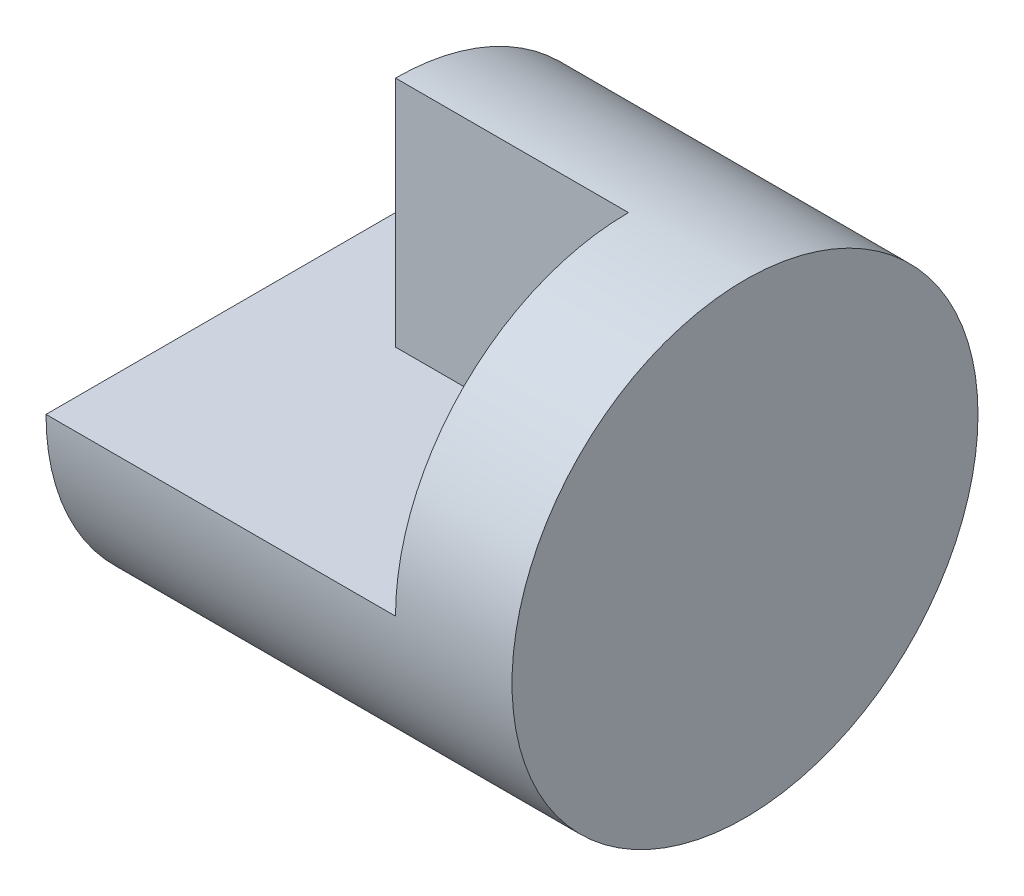
ISO-10303-21;
HEADER;
FILE_DESCRIPTION(('STEP AP214'),'2;1');
FILE_NAME('part.step','',(''),(''),'','','');
FILE_SCHEMA(('AUTOMOTIVE_DESIGN { 1 0 10303 214 1 1 1 1 }'));
ENDSEC;
DATA;
#1=APPLICATION_CONTEXT('core data for automotive mechanical design processes');
#2=APPLICATION_PROTOCOL_DEFINITION('international standard','automotive_design',2000,#1);
#3=PRODUCT_CONTEXT('',#1,'mechanical');
#4=PRODUCT('Part','Part','',(#3));
#5=PRODUCT_RELATED_PRODUCT_CATEGORY('part','',(#4));
#6=PRODUCT_DEFINITION_FORMATION('','',#4);
#7=PRODUCT_DEFINITION_CONTEXT('part definition',#1,'design');
#8=PRODUCT_DEFINITION('design','',#6,#7);
#9=PRODUCT_DEFINITION_SHAPE('','',#8);
#10=(LENGTH_UNIT() NAMED_UNIT(*) SI_UNIT(.MILLI.,.METRE.));
#11=(NAMED_UNIT(*) PLANE_ANGLE_UNIT() SI_UNIT($,.RADIAN.));
#12=(NAMED_UNIT(*) SI_UNIT($,.STERADIAN.) SOLID_ANGLE_UNIT());
#13=UNCERTAINTY_MEASURE_WITH_UNIT(LENGTH_MEASURE(1.E-05),#10,'distance_accuracy_value','');
#14=(GEOMETRIC_REPRESENTATION_CONTEXT(3) GLOBAL_UNCERTAINTY_ASSIGNED_CONTEXT((#13)) GLOBAL_UNIT_ASSIGNED_CONTEXT((#10,
#11,#12)) REPRESENTATION_CONTEXT('',''));
#15=CARTESIAN_POINT('',(0.,0.,0.));
#16=DIRECTION('',(0.,0.,1.));
#17=DIRECTION('',(1.,0.,0.));
#18=AXIS2_PLACEMENT_3D('',#15,#16,#17);
#19=CARTESIAN_POINT('',(2.,0.,0.));
#20=DIRECTION('',(-1.,0.,0.));
#21=DIRECTION('',(0.,0.,1.));
#22=AXIS2_PLACEMENT_3D('',#19,#20,#21);
#23=CYLINDRICAL_SURFACE('',#22,2.);
#24=CARTESIAN_POINT('',(2.,0.,0.));
#25=DIRECTION('',(1.,0.,0.));
#26=DIRECTION('',(0.,0.,-1.));
#27=AXIS2_PLACEMENT_3D('',#24,#25,#26);
#28=CIRCLE('',#27,2.);
#29=CARTESIAN_POINT('',(2.,0.,-2.));
#30=VERTEX_POINT('',#29);
#31=EDGE_CURVE('E86',#30,#30,#28,.T.);
#32=ORIENTED_EDGE('',*,*,#31,.F.);
#33=EDGE_LOOP('',(#32));
#34=FACE_BOUND('',#33,.T.);
#35=DIRECTION('',(-1.,0.,0.));
#36=VECTOR('',#35,1.);
#37=CARTESIAN_POINT('',(-1.,0.,-2.));
#38=LINE('',#37,#36);
#39=CARTESIAN_POINT('',(-1.,0.,-2.));
#40=VERTEX_POINT('',#39);
#41=CARTESIAN_POINT('',(-2.,0.,-2.));
#42=VERTEX_POINT('',#41);
#43=EDGE_CURVE('E47',#40,#42,#38,.T.);
#44=ORIENTED_EDGE('',*,*,#43,.F.);
#45=CARTESIAN_POINT('',(-1.,0.,0.));
#46=DIRECTION('',(-1.,0.,0.));
#47=DIRECTION('',(0.,0.,1.));
#48=AXIS2_PLACEMENT_3D('',#45,#46,#47);
#49=CIRCLE('',#48,2.);
#50=CARTESIAN_POINT('',(-1.,2.,0.));
#51=VERTEX_POINT('',#50);
#52=EDGE_CURVE('E11',#51,#40,#49,.T.);
#53=ORIENTED_EDGE('',*,*,#52,.F.);
#54=DIRECTION('',(-1.,0.,0.));
#55=VECTOR('',#54,1.);
#56=CARTESIAN_POINT('',(2.,2.,0.));
#57=LINE('',#56,#55);
#58=CARTESIAN_POINT('',(1.,2.,0.));
#59=VERTEX_POINT('',#58);
#60=EDGE_CURVE('E40',#59,#51,#57,.T.);
#61=ORIENTED_EDGE('',*,*,#60,.F.);
#62=CARTESIAN_POINT('',(1.,0.,0.));
#63=DIRECTION('',(-1.,0.,0.));
#64=DIRECTION('',(0.,0.,1.));
#65=AXIS2_PLACEMENT_3D('',#62,#63,#64);
#66=CIRCLE('',#65,2.);
#67=CARTESIAN_POINT('',(1.,0.,2.));
#68=VERTEX_POINT('',#67);
#69=EDGE_CURVE('E55',#68,#59,#66,.T.);
#70=ORIENTED_EDGE('',*,*,#69,.F.);
#71=DIRECTION('',(1.,0.,0.));
#72=VECTOR('',#71,1.);
#73=CARTESIAN_POINT('',(-2.,0.,2.));
#74=LINE('',#73,#72);
#75=CARTESIAN_POINT('',(-2.,0.,2.));
#76=VERTEX_POINT('',#75);
#77=EDGE_CURVE('E75',#76,#68,#74,.T.);
#78=ORIENTED_EDGE('',*,*,#77,.F.);
#79=CARTESIAN_POINT('',(-2.,0.,0.));
#80=DIRECTION('',(1.,0.,0.));
#81=DIRECTION('',(0.,0.,-1.));
#82=AXIS2_PLACEMENT_3D('',#79,#80,#81);
#83=CIRCLE('',#82,2.);
#84=EDGE_CURVE('E81',#76,#42,#83,.T.);
#85=ORIENTED_EDGE('',*,*,#84,.T.);
#86=EDGE_LOOP('',(#44,#53,#61,#70,#78,#85));
#87=FACE_BOUND('',#86,.T.);
#88=ADVANCED_FACE('F33',(#34,#87),#23,.T.);
#89=CARTESIAN_POINT('',(-2.,0.,0.));
#90=DIRECTION('',(1.,0.,0.));
#91=DIRECTION('',(0.,0.,-1.));
#92=AXIS2_PLACEMENT_3D('',#89,#90,#91);
#93=PLANE('',#92);
#94=DIRECTION('',(0.,0.,1.));
#95=VECTOR('',#94,1.);
#96=CARTESIAN_POINT('',(-2.,0.,-2.));
#97=LINE('',#96,#95);
#98=EDGE_CURVE('E71',#42,#76,#97,.T.);
#99=ORIENTED_EDGE('',*,*,#98,.F.);
#100=ORIENTED_EDGE('',*,*,#84,.F.);
#101=EDGE_LOOP('',(#99,#100));
#102=FACE_BOUND('',#101,.T.);
#103=ADVANCED_FACE('F85',(#102),#93,.F.);
#104=CARTESIAN_POINT('',(2.,0.,0.));
#105=DIRECTION('',(1.,0.,0.));
#106=DIRECTION('',(0.,0.,-1.));
#107=AXIS2_PLACEMENT_3D('',#104,#105,#106);
#108=PLANE('',#107);
#109=ORIENTED_EDGE('',*,*,#31,.T.);
#110=EDGE_LOOP('',(#109));
#111=FACE_BOUND('',#110,.T.);
#112=ADVANCED_FACE('F112',(#111),#108,.T.);
#113=CARTESIAN_POINT('',(1.,4.,2.));
#114=DIRECTION('',(-1.,0.,0.));
#115=DIRECTION('',(0.,0.,1.));
#116=AXIS2_PLACEMENT_3D('',#113,#114,#115);
#117=PLANE('',#116);
#118=ORIENTED_EDGE('',*,*,#69,.T.);
#119=DIRECTION('',(0.,-1.,0.));
#120=VECTOR('',#119,1.);
#121=CARTESIAN_POINT('',(1.,4.,0.));
#122=LINE('',#121,#120);
#123=CARTESIAN_POINT('',(1.,0.,0.));
#124=VERTEX_POINT('',#123);
#125=EDGE_CURVE('E87',#59,#124,#122,.T.);
#126=ORIENTED_EDGE('',*,*,#125,.T.);
#127=DIRECTION('',(0.,0.,-1.));
#128=VECTOR('',#127,1.);
#129=CARTESIAN_POINT('',(1.,0.,2.));
#130=LINE('',#129,#128);
#131=EDGE_CURVE('E83',#68,#124,#130,.T.);
#132=ORIENTED_EDGE('',*,*,#131,.F.);
#133=EDGE_LOOP('',(#118,#126,#132));
#134=FACE_BOUND('',#133,.T.);
#135=ADVANCED_FACE('F110',(#134),#117,.T.);
#136=CARTESIAN_POINT('',(1.,4.,0.));
#137=DIRECTION('',(0.,0.,1.));
#138=DIRECTION('',(1.,0.,0.));
#139=AXIS2_PLACEMENT_3D('',#136,#137,#138);
#140=PLANE('',#139);
#141=ORIENTED_EDGE('',*,*,#60,.T.);
#142=DIRECTION('',(0.,-1.,0.));
#143=VECTOR('',#142,1.);
#144=CARTESIAN_POINT('',(-1.,4.,0.));
#145=LINE('',#144,#143);
#146=CARTESIAN_POINT('',(-1.,0.,0.));
#147=VERTEX_POINT('',#146);
#148=EDGE_CURVE('E91',#51,#147,#145,.T.);
#149=ORIENTED_EDGE('',*,*,#148,.T.);
#150=DIRECTION('',(-1.,0.,0.));
#151=VECTOR('',#150,1.);
#152=CARTESIAN_POINT('',(1.,0.,0.));
#153=LINE('',#152,#151);
#154=EDGE_CURVE('E108',#124,#147,#153,.T.);
#155=ORIENTED_EDGE('',*,*,#154,.F.);
#156=ORIENTED_EDGE('',*,*,#125,.F.);
#157=EDGE_LOOP('',(#141,#149,#155,#156));
#158=FACE_BOUND('',#157,.T.);
#159=ADVANCED_FACE('F96',(#158),#140,.T.);
#160=CARTESIAN_POINT('',(-1.,4.,0.));
#161=DIRECTION('',(-1.,0.,0.));
#162=DIRECTION('',(0.,0.,1.));
#163=AXIS2_PLACEMENT_3D('',#160,#161,#162);
#164=PLANE('',#163);
#165=ORIENTED_EDGE('',*,*,#52,.T.);
#166=DIRECTION('',(0.,0.,-1.));
#167=VECTOR('',#166,1.);
#168=CARTESIAN_POINT('',(-1.,0.,0.));
#169=LINE('',#168,#167);
#170=EDGE_CURVE('E103',#147,#40,#169,.T.);
#171=ORIENTED_EDGE('',*,*,#170,.F.);
#172=ORIENTED_EDGE('',*,*,#148,.F.);
#173=EDGE_LOOP('',(#165,#171,#172));
#174=FACE_BOUND('',#173,.T.);
#175=ADVANCED_FACE('F102',(#174),#164,.T.);
#176=CARTESIAN_POINT('',(0.,0.,0.));
#177=DIRECTION('',(0.,1.,0.));
#178=DIRECTION('',(0.,0.,1.));
#179=AXIS2_PLACEMENT_3D('',#176,#177,#178);
#180=PLANE('',#179);
#181=ORIENTED_EDGE('',*,*,#43,.T.);
#182=ORIENTED_EDGE('',*,*,#98,.T.);
#183=ORIENTED_EDGE('',*,*,#77,.T.);
#184=ORIENTED_EDGE('',*,*,#131,.T.);
#185=ORIENTED_EDGE('',*,*,#154,.T.);
#186=ORIENTED_EDGE('',*,*,#170,.T.);
#187=EDGE_LOOP('',(#181,#182,#183,#184,#185,#186));
#188=FACE_BOUND('',#187,.T.);
#189=ADVANCED_FACE('F73',(#188),#180,.T.);
#190=CLOSED_SHELL('',(#88,#103,#112,#135,#159,#175,#189));
#191=MANIFOLD_SOLID_BREP('B2',#190);
#192=ADVANCED_BREP_SHAPE_REPRESENTATION('',(#18,#191),#14);
#193=SHAPE_DEFINITION_REPRESENTATION(#9,#192);
ENDSEC;
END-ISO-10303-21;
